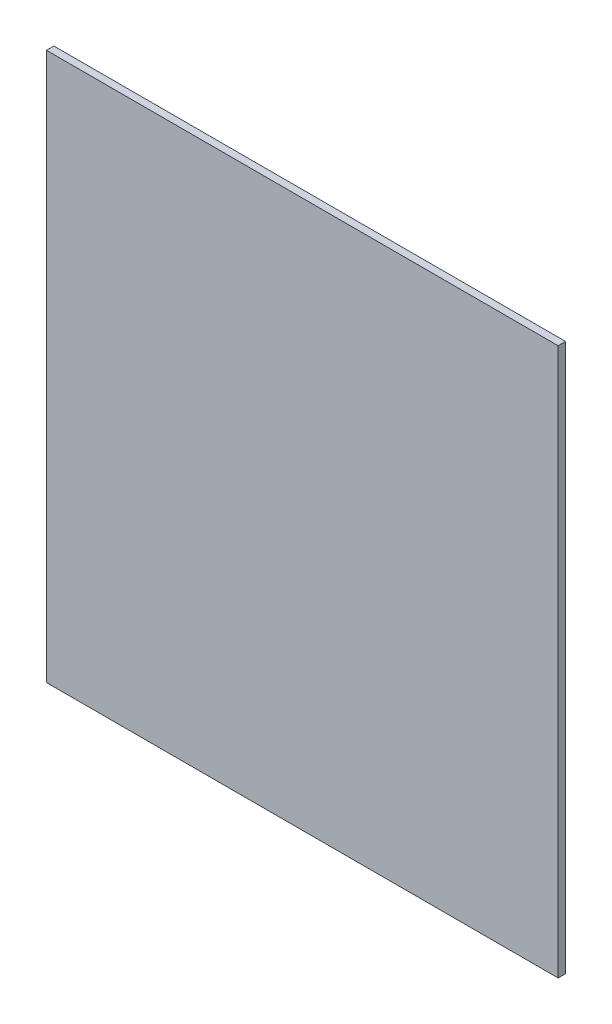
ISO-10303-21;
HEADER;
FILE_DESCRIPTION(('STEP AP214'),'2;1');
FILE_NAME('part.step','',(''),(''),'','','');
FILE_SCHEMA(('AUTOMOTIVE_DESIGN { 1 0 10303 214 1 1 1 1 }'));
ENDSEC;
DATA;
#1=APPLICATION_CONTEXT('core data for automotive mechanical design processes');
#2=APPLICATION_PROTOCOL_DEFINITION('international standard','automotive_design',2000,#1);
#3=PRODUCT_CONTEXT('',#1,'mechanical');
#4=PRODUCT('Part','Part','',(#3));
#5=PRODUCT_RELATED_PRODUCT_CATEGORY('part','',(#4));
#6=PRODUCT_DEFINITION_FORMATION('','',#4);
#7=PRODUCT_DEFINITION_CONTEXT('part definition',#1,'design');
#8=PRODUCT_DEFINITION('design','',#6,#7);
#9=PRODUCT_DEFINITION_SHAPE('','',#8);
#10=(LENGTH_UNIT() NAMED_UNIT(*) SI_UNIT(.MILLI.,.METRE.));
#11=(NAMED_UNIT(*) PLANE_ANGLE_UNIT() SI_UNIT($,.RADIAN.));
#12=(NAMED_UNIT(*) SI_UNIT($,.STERADIAN.) SOLID_ANGLE_UNIT());
#13=UNCERTAINTY_MEASURE_WITH_UNIT(LENGTH_MEASURE(1.E-05),#10,'distance_accuracy_value','');
#14=(GEOMETRIC_REPRESENTATION_CONTEXT(3) GLOBAL_UNCERTAINTY_ASSIGNED_CONTEXT((#13)) GLOBAL_UNIT_ASSIGNED_CONTEXT((#10,
#11,#12)) REPRESENTATION_CONTEXT('',''));
#15=CARTESIAN_POINT('',(0.,0.,0.));
#16=DIRECTION('',(0.,0.,1.));
#17=DIRECTION('',(1.,0.,0.));
#18=AXIS2_PLACEMENT_3D('',#15,#16,#17);
#19=CARTESIAN_POINT('',(100.,107.,2.9));
#20=DIRECTION('',(-1.,0.,0.));
#21=DIRECTION('',(0.,-1.,0.));
#22=AXIS2_PLACEMENT_3D('',#19,#20,#21);
#23=PLANE('',#22);
#24=DIRECTION('',(0.,1.,0.));
#25=VECTOR('',#24,1.);
#26=CARTESIAN_POINT('',(100.,107.,0.));
#27=LINE('',#26,#25);
#28=CARTESIAN_POINT('',(100.,-107.,0.));
#29=VERTEX_POINT('',#28);
#30=CARTESIAN_POINT('',(100.,107.,0.));
#31=VERTEX_POINT('',#30);
#32=EDGE_CURVE('E99',#29,#31,#27,.T.);
#33=ORIENTED_EDGE('',*,*,#32,.T.);
#34=DIRECTION('',(0.,0.,-1.));
#35=VECTOR('',#34,1.);
#36=CARTESIAN_POINT('',(100.,107.,2.9));
#37=LINE('',#36,#35);
#38=CARTESIAN_POINT('',(100.,107.,2.9));
#39=VERTEX_POINT('',#38);
#40=EDGE_CURVE('E11',#39,#31,#37,.T.);
#41=ORIENTED_EDGE('',*,*,#40,.F.);
#42=DIRECTION('',(0.,1.,0.));
#43=VECTOR('',#42,1.);
#44=CARTESIAN_POINT('',(100.,107.,2.9));
#45=LINE('',#44,#43);
#46=CARTESIAN_POINT('',(100.,-107.,2.9));
#47=VERTEX_POINT('',#46);
#48=EDGE_CURVE('E87',#47,#39,#45,.T.);
#49=ORIENTED_EDGE('',*,*,#48,.F.);
#50=DIRECTION('',(0.,0.,-1.));
#51=VECTOR('',#50,1.);
#52=CARTESIAN_POINT('',(100.,-107.,2.9));
#53=LINE('',#52,#51);
#54=EDGE_CURVE('E95',#47,#29,#53,.T.);
#55=ORIENTED_EDGE('',*,*,#54,.T.);
#56=EDGE_LOOP('',(#33,#41,#49,#55));
#57=FACE_BOUND('',#56,.T.);
#58=ADVANCED_FACE('F36',(#57),#23,.F.);
#59=CARTESIAN_POINT('',(-100.,107.,2.9));
#60=DIRECTION('',(0.,-1.,0.));
#61=DIRECTION('',(0.,0.,-1.));
#62=AXIS2_PLACEMENT_3D('',#59,#60,#61);
#63=PLANE('',#62);
#64=DIRECTION('',(-1.,0.,0.));
#65=VECTOR('',#64,1.);
#66=CARTESIAN_POINT('',(-100.,107.,0.));
#67=LINE('',#66,#65);
#68=CARTESIAN_POINT('',(-100.,107.,0.));
#69=VERTEX_POINT('',#68);
#70=EDGE_CURVE('E91',#31,#69,#67,.T.);
#71=ORIENTED_EDGE('',*,*,#70,.T.);
#72=DIRECTION('',(0.,0.,-1.));
#73=VECTOR('',#72,1.);
#74=CARTESIAN_POINT('',(-100.,107.,2.9));
#75=LINE('',#74,#73);
#76=CARTESIAN_POINT('',(-100.,107.,2.9));
#77=VERTEX_POINT('',#76);
#78=EDGE_CURVE('E44',#77,#69,#75,.T.);
#79=ORIENTED_EDGE('',*,*,#78,.F.);
#80=DIRECTION('',(-1.,0.,0.));
#81=VECTOR('',#80,1.);
#82=CARTESIAN_POINT('',(-100.,107.,2.9));
#83=LINE('',#82,#81);
#84=EDGE_CURVE('E82',#39,#77,#83,.T.);
#85=ORIENTED_EDGE('',*,*,#84,.F.);
#86=ORIENTED_EDGE('',*,*,#40,.T.);
#87=EDGE_LOOP('',(#71,#79,#85,#86));
#88=FACE_BOUND('',#87,.T.);
#89=ADVANCED_FACE('F90',(#88),#63,.F.);
#90=CARTESIAN_POINT('',(-100.,107.,2.9));
#91=DIRECTION('',(1.,0.,0.));
#92=DIRECTION('',(0.,1.,0.));
#93=AXIS2_PLACEMENT_3D('',#90,#91,#92);
#94=PLANE('',#93);
#95=DIRECTION('',(0.,-1.,0.));
#96=VECTOR('',#95,1.);
#97=CARTESIAN_POINT('',(-100.,107.,0.));
#98=LINE('',#97,#96);
#99=CARTESIAN_POINT('',(-100.,-107.,0.));
#100=VERTEX_POINT('',#99);
#101=EDGE_CURVE('E69',#69,#100,#98,.T.);
#102=ORIENTED_EDGE('',*,*,#101,.T.);
#103=DIRECTION('',(0.,0.,-1.));
#104=VECTOR('',#103,1.);
#105=CARTESIAN_POINT('',(-100.,-107.,2.9));
#106=LINE('',#105,#104);
#107=CARTESIAN_POINT('',(-100.,-107.,2.9));
#108=VERTEX_POINT('',#107);
#109=EDGE_CURVE('E92',#108,#100,#106,.T.);
#110=ORIENTED_EDGE('',*,*,#109,.F.);
#111=DIRECTION('',(0.,-1.,0.));
#112=VECTOR('',#111,1.);
#113=CARTESIAN_POINT('',(-100.,107.,2.9));
#114=LINE('',#113,#112);
#115=EDGE_CURVE('E85',#77,#108,#114,.T.);
#116=ORIENTED_EDGE('',*,*,#115,.F.);
#117=ORIENTED_EDGE('',*,*,#78,.T.);
#118=EDGE_LOOP('',(#102,#110,#116,#117));
#119=FACE_BOUND('',#118,.T.);
#120=ADVANCED_FACE('F93',(#119),#94,.F.);
#121=CARTESIAN_POINT('',(-100.,-107.,2.9));
#122=DIRECTION('',(0.,1.,0.));
#123=DIRECTION('',(0.,0.,1.));
#124=AXIS2_PLACEMENT_3D('',#121,#122,#123);
#125=PLANE('',#124);
#126=DIRECTION('',(1.,0.,0.));
#127=VECTOR('',#126,1.);
#128=CARTESIAN_POINT('',(-100.,-107.,0.));
#129=LINE('',#128,#127);
#130=EDGE_CURVE('E75',#100,#29,#129,.T.);
#131=ORIENTED_EDGE('',*,*,#130,.T.);
#132=ORIENTED_EDGE('',*,*,#54,.F.);
#133=DIRECTION('',(1.,0.,0.));
#134=VECTOR('',#133,1.);
#135=CARTESIAN_POINT('',(-100.,-107.,2.9));
#136=LINE('',#135,#134);
#137=EDGE_CURVE('E52',#108,#47,#136,.T.);
#138=ORIENTED_EDGE('',*,*,#137,.F.);
#139=ORIENTED_EDGE('',*,*,#109,.T.);
#140=EDGE_LOOP('',(#131,#132,#138,#139));
#141=FACE_BOUND('',#140,.T.);
#142=ADVANCED_FACE('F106',(#141),#125,.F.);
#143=CARTESIAN_POINT('',(0.,0.,2.9));
#144=DIRECTION('',(0.,0.,1.));
#145=DIRECTION('',(1.,0.,0.));
#146=AXIS2_PLACEMENT_3D('',#143,#144,#145);
#147=PLANE('',#146);
#148=ORIENTED_EDGE('',*,*,#48,.T.);
#149=ORIENTED_EDGE('',*,*,#84,.T.);
#150=ORIENTED_EDGE('',*,*,#115,.T.);
#151=ORIENTED_EDGE('',*,*,#137,.T.);
#152=EDGE_LOOP('',(#148,#149,#150,#151));
#153=FACE_BOUND('',#152,.T.);
#154=ADVANCED_FACE('F83',(#153),#147,.T.);
#155=CARTESIAN_POINT('',(0.,0.,0.));
#156=DIRECTION('',(0.,0.,1.));
#157=DIRECTION('',(1.,0.,0.));
#158=AXIS2_PLACEMENT_3D('',#155,#156,#157);
#159=PLANE('',#158);
#160=ORIENTED_EDGE('',*,*,#32,.F.);
#161=ORIENTED_EDGE('',*,*,#130,.F.);
#162=ORIENTED_EDGE('',*,*,#101,.F.);
#163=ORIENTED_EDGE('',*,*,#70,.F.);
#164=EDGE_LOOP('',(#160,#161,#162,#163));
#165=FACE_BOUND('',#164,.T.);
#166=ADVANCED_FACE('F109',(#165),#159,.F.);
#167=CLOSED_SHELL('',(#58,#89,#120,#142,#154,#166));
#168=MANIFOLD_SOLID_BREP('B2',#167);
#169=ADVANCED_BREP_SHAPE_REPRESENTATION('',(#18,#168),#14);
#170=SHAPE_DEFINITION_REPRESENTATION(#9,#169);
ENDSEC;
END-ISO-10303-21;
